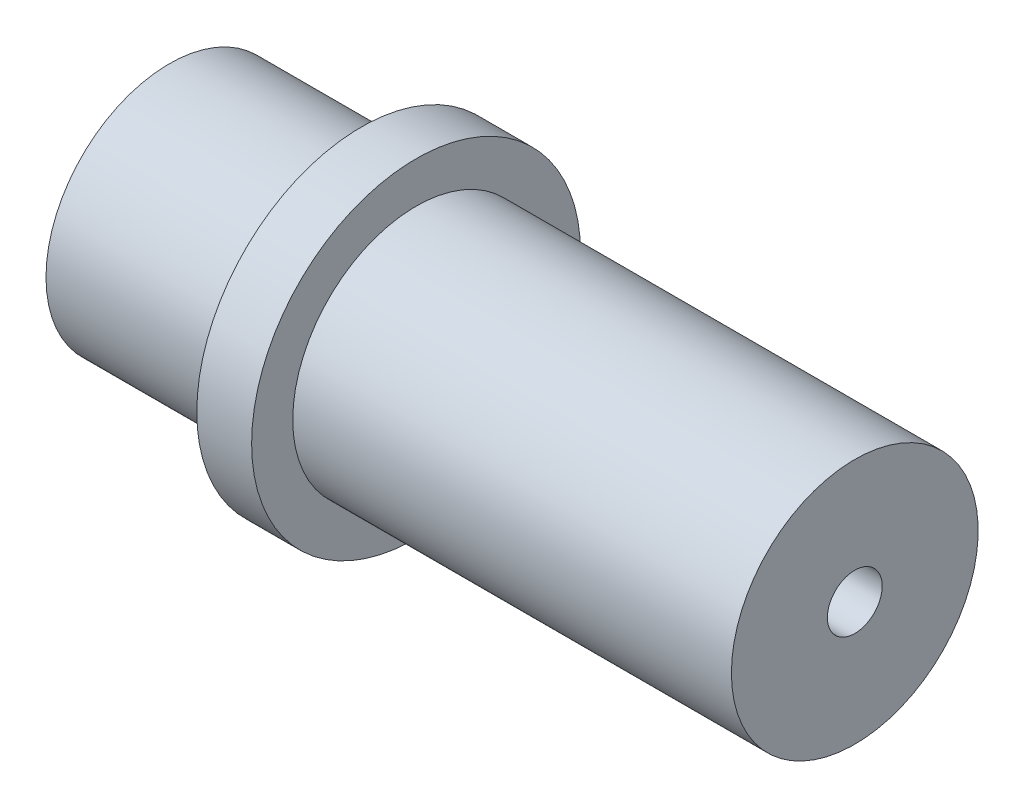
ISO-10303-21;
HEADER;
FILE_DESCRIPTION(('STEP AP214'),'2;1');
FILE_NAME('part.step','',(''),(''),'','','');
FILE_SCHEMA(('AUTOMOTIVE_DESIGN { 1 0 10303 214 1 1 1 1 }'));
ENDSEC;
DATA;
#1=APPLICATION_CONTEXT('core data for automotive mechanical design processes');
#2=APPLICATION_PROTOCOL_DEFINITION('international standard','automotive_design',2000,#1);
#3=PRODUCT_CONTEXT('',#1,'mechanical');
#4=PRODUCT('Part','Part','',(#3));
#5=PRODUCT_RELATED_PRODUCT_CATEGORY('part','',(#4));
#6=PRODUCT_DEFINITION_FORMATION('','',#4);
#7=PRODUCT_DEFINITION_CONTEXT('part definition',#1,'design');
#8=PRODUCT_DEFINITION('design','',#6,#7);
#9=PRODUCT_DEFINITION_SHAPE('','',#8);
#10=(LENGTH_UNIT() NAMED_UNIT(*) SI_UNIT(.MILLI.,.METRE.));
#11=(NAMED_UNIT(*) PLANE_ANGLE_UNIT() SI_UNIT($,.RADIAN.));
#12=(NAMED_UNIT(*) SI_UNIT($,.STERADIAN.) SOLID_ANGLE_UNIT());
#13=UNCERTAINTY_MEASURE_WITH_UNIT(LENGTH_MEASURE(1.E-05),#10,'distance_accuracy_value','');
#14=(GEOMETRIC_REPRESENTATION_CONTEXT(3) GLOBAL_UNCERTAINTY_ASSIGNED_CONTEXT((#13)) GLOBAL_UNIT_ASSIGNED_CONTEXT((#10,
#11,#12)) REPRESENTATION_CONTEXT('',''));
#15=CARTESIAN_POINT('',(0.,0.,0.));
#16=DIRECTION('',(0.,0.,1.));
#17=DIRECTION('',(1.,0.,0.));
#18=AXIS2_PLACEMENT_3D('',#15,#16,#17);
#19=CARTESIAN_POINT('',(15.625,0.,0.));
#20=DIRECTION('',(-1.,0.,0.));
#21=DIRECTION('',(0.,0.,1.));
#22=AXIS2_PLACEMENT_3D('',#19,#20,#21);
#23=CYLINDRICAL_SURFACE('',#22,1.25);
#24=CARTESIAN_POINT('',(15.625,0.,0.));
#25=DIRECTION('',(-1.,0.,0.));
#26=DIRECTION('',(0.,0.,1.));
#27=AXIS2_PLACEMENT_3D('',#24,#25,#26);
#28=CIRCLE('',#27,1.25);
#29=CARTESIAN_POINT('',(15.625,0.,1.25));
#30=VERTEX_POINT('',#29);
#31=EDGE_CURVE('E57',#30,#30,#28,.T.);
#32=ORIENTED_EDGE('',*,*,#31,.F.);
#33=EDGE_LOOP('',(#32));
#34=FACE_BOUND('',#33,.T.);
#35=CARTESIAN_POINT('',(6.125,0.,0.));
#36=DIRECTION('',(-1.,0.,0.));
#37=DIRECTION('',(0.,0.,1.));
#38=AXIS2_PLACEMENT_3D('',#35,#36,#37);
#39=CIRCLE('',#38,1.25);
#40=CARTESIAN_POINT('',(6.125,0.,1.25));
#41=VERTEX_POINT('',#40);
#42=EDGE_CURVE('E35',#41,#41,#39,.F.);
#43=ORIENTED_EDGE('',*,*,#42,.F.);
#44=EDGE_LOOP('',(#43));
#45=FACE_BOUND('',#44,.T.);
#46=ADVANCED_FACE('F31',(#34,#45),#23,.F.);
#47=CARTESIAN_POINT('',(-15.625,0.,0.));
#48=DIRECTION('',(-1.,0.,0.));
#49=DIRECTION('',(0.,0.,1.));
#50=AXIS2_PLACEMENT_3D('',#47,#48,#49);
#51=PLANE('',#50);
#52=CARTESIAN_POINT('',(-15.625,0.,0.));
#53=DIRECTION('',(-1.,0.,0.));
#54=DIRECTION('',(0.,0.,1.));
#55=AXIS2_PLACEMENT_3D('',#52,#53,#54);
#56=CIRCLE('',#55,1.875);
#57=CARTESIAN_POINT('',(-15.625,0.,1.875));
#58=VERTEX_POINT('',#57);
#59=EDGE_CURVE('E60',#58,#58,#56,.T.);
#60=ORIENTED_EDGE('',*,*,#59,.F.);
#61=EDGE_LOOP('',(#60));
#62=FACE_BOUND('',#61,.T.);
#63=CARTESIAN_POINT('',(-15.625,0.,0.));
#64=DIRECTION('',(-1.,0.,0.));
#65=DIRECTION('',(0.,0.,1.));
#66=AXIS2_PLACEMENT_3D('',#63,#64,#65);
#67=CIRCLE('',#66,5.625);
#68=CARTESIAN_POINT('',(-15.625,0.,5.625));
#69=VERTEX_POINT('',#68);
#70=EDGE_CURVE('E54',#69,#69,#67,.T.);
#71=ORIENTED_EDGE('',*,*,#70,.T.);
#72=EDGE_LOOP('',(#71));
#73=FACE_BOUND('',#72,.T.);
#74=ADVANCED_FACE('F33',(#62,#73),#51,.T.);
#75=CARTESIAN_POINT('',(15.625,0.,0.));
#76=DIRECTION('',(1.,0.,0.));
#77=DIRECTION('',(0.,0.,-1.));
#78=AXIS2_PLACEMENT_3D('',#75,#76,#77);
#79=PLANE('',#78);
#80=ORIENTED_EDGE('',*,*,#31,.T.);
#81=EDGE_LOOP('',(#80));
#82=FACE_BOUND('',#81,.T.);
#83=CARTESIAN_POINT('',(15.625,0.,0.));
#84=DIRECTION('',(-1.,0.,0.));
#85=DIRECTION('',(0.,0.,1.));
#86=AXIS2_PLACEMENT_3D('',#83,#84,#85);
#87=CIRCLE('',#86,5.62499999999999);
#88=CARTESIAN_POINT('',(15.625,0.,5.62499999999999));
#89=VERTEX_POINT('',#88);
#90=EDGE_CURVE('E10',#89,#89,#87,.T.);
#91=ORIENTED_EDGE('',*,*,#90,.F.);
#92=EDGE_LOOP('',(#91));
#93=FACE_BOUND('',#92,.T.);
#94=ADVANCED_FACE('F78',(#82,#93),#79,.T.);
#95=CARTESIAN_POINT('',(-15.625,0.,0.));
#96=DIRECTION('',(-1.,0.,0.));
#97=DIRECTION('',(0.,0.,1.));
#98=AXIS2_PLACEMENT_3D('',#95,#96,#97);
#99=CYLINDRICAL_SURFACE('',#98,5.625);
#100=ORIENTED_EDGE('',*,*,#90,.T.);
#101=EDGE_LOOP('',(#100));
#102=FACE_BOUND('',#101,.T.);
#103=CARTESIAN_POINT('',(-4.375,0.,0.));
#104=DIRECTION('',(-1.,0.,0.));
#105=DIRECTION('',(0.,0.,1.));
#106=AXIS2_PLACEMENT_3D('',#103,#104,#105);
#107=CIRCLE('',#106,5.625);
#108=CARTESIAN_POINT('',(-4.375,0.,5.625));
#109=VERTEX_POINT('',#108);
#110=EDGE_CURVE('E39',#109,#109,#107,.T.);
#111=ORIENTED_EDGE('',*,*,#110,.F.);
#112=EDGE_LOOP('',(#111));
#113=FACE_BOUND('',#112,.T.);
#114=ADVANCED_FACE('F100',(#102,#113),#99,.T.);
#115=CARTESIAN_POINT('',(-4.375,0.,0.));
#116=DIRECTION('',(1.,0.,0.));
#117=DIRECTION('',(0.,0.,-1.));
#118=AXIS2_PLACEMENT_3D('',#115,#116,#117);
#119=PLANE('',#118);
#120=ORIENTED_EDGE('',*,*,#110,.T.);
#121=EDGE_LOOP('',(#120));
#122=FACE_BOUND('',#121,.T.);
#123=CARTESIAN_POINT('',(-4.375,0.,0.));
#124=DIRECTION('',(-1.,0.,0.));
#125=DIRECTION('',(0.,0.,1.));
#126=AXIS2_PLACEMENT_3D('',#123,#124,#125);
#127=CIRCLE('',#126,7.5);
#128=CARTESIAN_POINT('',(-4.375,0.,7.5));
#129=VERTEX_POINT('',#128);
#130=EDGE_CURVE('E43',#129,#129,#127,.T.);
#131=ORIENTED_EDGE('',*,*,#130,.F.);
#132=EDGE_LOOP('',(#131));
#133=FACE_BOUND('',#132,.T.);
#134=ADVANCED_FACE('F96',(#122,#133),#119,.T.);
#135=CARTESIAN_POINT('',(-15.625,0.,0.));
#136=DIRECTION('',(-1.,0.,0.));
#137=DIRECTION('',(0.,0.,1.));
#138=AXIS2_PLACEMENT_3D('',#135,#136,#137);
#139=CYLINDRICAL_SURFACE('',#138,7.5);
#140=ORIENTED_EDGE('',*,*,#130,.T.);
#141=EDGE_LOOP('',(#140));
#142=FACE_BOUND('',#141,.T.);
#143=CARTESIAN_POINT('',(-6.875,0.,0.));
#144=DIRECTION('',(-1.,0.,0.));
#145=DIRECTION('',(0.,0.,1.));
#146=AXIS2_PLACEMENT_3D('',#143,#144,#145);
#147=CIRCLE('',#146,7.5);
#148=CARTESIAN_POINT('',(-6.875,0.,7.5));
#149=VERTEX_POINT('',#148);
#150=EDGE_CURVE('E48',#149,#149,#147,.T.);
#151=ORIENTED_EDGE('',*,*,#150,.F.);
#152=EDGE_LOOP('',(#151));
#153=FACE_BOUND('',#152,.T.);
#154=ADVANCED_FACE('F92',(#142,#153),#139,.T.);
#155=CARTESIAN_POINT('',(-6.875,0.,0.));
#156=DIRECTION('',(-1.,0.,0.));
#157=DIRECTION('',(0.,0.,1.));
#158=AXIS2_PLACEMENT_3D('',#155,#156,#157);
#159=PLANE('',#158);
#160=ORIENTED_EDGE('',*,*,#150,.T.);
#161=EDGE_LOOP('',(#160));
#162=FACE_BOUND('',#161,.T.);
#163=CARTESIAN_POINT('',(-6.875,0.,0.));
#164=DIRECTION('',(-1.,0.,0.));
#165=DIRECTION('',(0.,0.,1.));
#166=AXIS2_PLACEMENT_3D('',#163,#164,#165);
#167=CIRCLE('',#166,5.625);
#168=CARTESIAN_POINT('',(-6.875,0.,5.625));
#169=VERTEX_POINT('',#168);
#170=EDGE_CURVE('E51',#169,#169,#167,.T.);
#171=ORIENTED_EDGE('',*,*,#170,.F.);
#172=EDGE_LOOP('',(#171));
#173=FACE_BOUND('',#172,.T.);
#174=ADVANCED_FACE('F88',(#162,#173),#159,.T.);
#175=CARTESIAN_POINT('',(-15.625,0.,0.));
#176=DIRECTION('',(-1.,0.,0.));
#177=DIRECTION('',(0.,0.,1.));
#178=AXIS2_PLACEMENT_3D('',#175,#176,#177);
#179=CYLINDRICAL_SURFACE('',#178,5.625);
#180=ORIENTED_EDGE('',*,*,#170,.T.);
#181=EDGE_LOOP('',(#180));
#182=FACE_BOUND('',#181,.T.);
#183=ORIENTED_EDGE('',*,*,#70,.F.);
#184=EDGE_LOOP('',(#183));
#185=FACE_BOUND('',#184,.T.);
#186=ADVANCED_FACE('F85',(#182,#185),#179,.T.);
#187=CARTESIAN_POINT('',(6.125,0.,0.));
#188=DIRECTION('',(-1.,0.,0.));
#189=DIRECTION('',(0.,0.,1.));
#190=AXIS2_PLACEMENT_3D('',#187,#188,#189);
#191=PLANE('',#190);
#192=CARTESIAN_POINT('',(6.125,0.,0.));
#193=DIRECTION('',(-1.,0.,0.));
#194=DIRECTION('',(0.,0.,1.));
#195=AXIS2_PLACEMENT_3D('',#192,#193,#194);
#196=CIRCLE('',#195,1.875);
#197=CARTESIAN_POINT('',(6.125,0.,1.875));
#198=VERTEX_POINT('',#197);
#199=EDGE_CURVE('E63',#198,#198,#196,.T.);
#200=ORIENTED_EDGE('',*,*,#199,.T.);
#201=EDGE_LOOP('',(#200));
#202=FACE_BOUND('',#201,.T.);
#203=ORIENTED_EDGE('',*,*,#42,.T.);
#204=EDGE_LOOP('',(#203));
#205=FACE_BOUND('',#204,.T.);
#206=ADVANCED_FACE('F70',(#202,#205),#191,.T.);
#207=CARTESIAN_POINT('',(6.125,0.,0.));
#208=DIRECTION('',(-1.,0.,0.));
#209=DIRECTION('',(0.,0.,1.));
#210=AXIS2_PLACEMENT_3D('',#207,#208,#209);
#211=CYLINDRICAL_SURFACE('',#210,1.875);
#212=ORIENTED_EDGE('',*,*,#199,.F.);
#213=EDGE_LOOP('',(#212));
#214=FACE_BOUND('',#213,.T.);
#215=ORIENTED_EDGE('',*,*,#59,.T.);
#216=EDGE_LOOP('',(#215));
#217=FACE_BOUND('',#216,.T.);
#218=ADVANCED_FACE('F83',(#214,#217),#211,.F.);
#219=CLOSED_SHELL('',(#46,#74,#94,#114,#134,#154,#174,#186,#206,#218));
#220=MANIFOLD_SOLID_BREP('B2',#219);
#221=ADVANCED_BREP_SHAPE_REPRESENTATION('',(#18,#220),#14);
#222=SHAPE_DEFINITION_REPRESENTATION(#9,#221);
ENDSEC;
END-ISO-10303-21;
